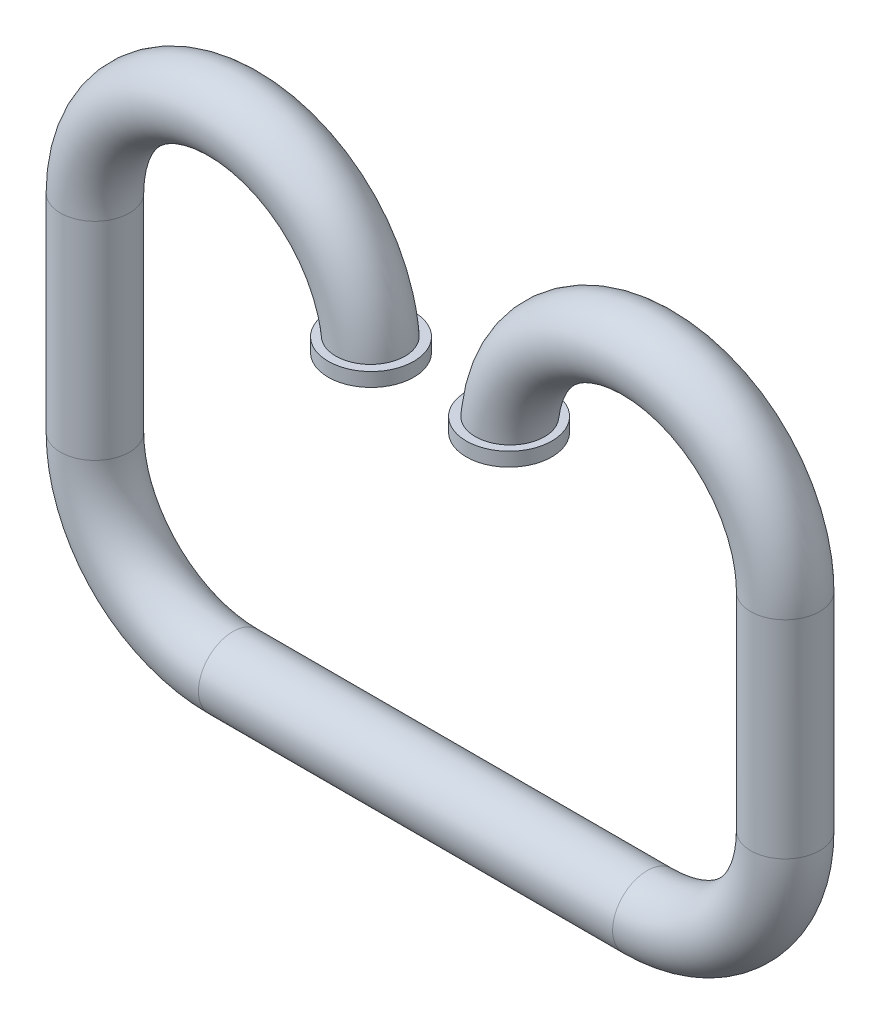
ISO-10303-21;
HEADER;
FILE_DESCRIPTION(('STEP AP214'),'2;1');
FILE_NAME('part.step','',(''),(''),'','','');
FILE_SCHEMA(('AUTOMOTIVE_DESIGN { 1 0 10303 214 1 1 1 1 }'));
ENDSEC;
DATA;
#1=APPLICATION_CONTEXT('core data for automotive mechanical design processes');
#2=APPLICATION_PROTOCOL_DEFINITION('international standard','automotive_design',2000,#1);
#3=PRODUCT_CONTEXT('',#1,'mechanical');
#4=PRODUCT('Part','Part','',(#3));
#5=PRODUCT_RELATED_PRODUCT_CATEGORY('part','',(#4));
#6=PRODUCT_DEFINITION_FORMATION('','',#4);
#7=PRODUCT_DEFINITION_CONTEXT('part definition',#1,'design');
#8=PRODUCT_DEFINITION('design','',#6,#7);
#9=PRODUCT_DEFINITION_SHAPE('','',#8);
#10=(LENGTH_UNIT() NAMED_UNIT(*) SI_UNIT(.MILLI.,.METRE.));
#11=(NAMED_UNIT(*) PLANE_ANGLE_UNIT() SI_UNIT($,.RADIAN.));
#12=(NAMED_UNIT(*) SI_UNIT($,.STERADIAN.) SOLID_ANGLE_UNIT());
#13=UNCERTAINTY_MEASURE_WITH_UNIT(LENGTH_MEASURE(1.E-05),#10,'distance_accuracy_value','');
#14=(GEOMETRIC_REPRESENTATION_CONTEXT(3) GLOBAL_UNCERTAINTY_ASSIGNED_CONTEXT((#13)) GLOBAL_UNIT_ASSIGNED_CONTEXT((#10,
#11,#12)) REPRESENTATION_CONTEXT('',''));
#15=CARTESIAN_POINT('',(0.,0.,0.));
#16=DIRECTION('',(0.,0.,1.));
#17=DIRECTION('',(1.,0.,0.));
#18=AXIS2_PLACEMENT_3D('',#15,#16,#17);
#19=CARTESIAN_POINT('',(-1.,-2.5,0.));
#20=DIRECTION('',(1.,0.,0.));
#21=DIRECTION('',(0.,1.,0.));
#22=AXIS2_PLACEMENT_3D('',#19,#20,#21);
#23=CYLINDRICAL_SURFACE('',#22,0.25);
#24=CARTESIAN_POINT('',(-1.,-2.5,0.));
#25=DIRECTION('',(1.,0.,0.));
#26=DIRECTION('',(0.,1.,0.));
#27=AXIS2_PLACEMENT_3D('',#24,#25,#26);
#28=CIRCLE('',#27,0.25);
#29=CARTESIAN_POINT('',(-1.,-2.75,0.));
#30=VERTEX_POINT('',#29);
#31=EDGE_CURVE('E10',#30,#30,#28,.T.);
#32=ORIENTED_EDGE('',*,*,#31,.T.);
#33=EDGE_LOOP('',(#32));
#34=FACE_BOUND('',#33,.T.);
#35=CARTESIAN_POINT('',(2.,-2.5,0.));
#36=DIRECTION('',(1.,0.,0.));
#37=DIRECTION('',(0.,1.,0.));
#38=AXIS2_PLACEMENT_3D('',#35,#36,#37);
#39=CIRCLE('',#38,0.25);
#40=CARTESIAN_POINT('',(2.,-2.75,0.));
#41=VERTEX_POINT('',#40);
#42=EDGE_CURVE('E74',#41,#41,#39,.T.);
#43=ORIENTED_EDGE('',*,*,#42,.F.);
#44=EDGE_LOOP('',(#43));
#45=FACE_BOUND('',#44,.T.);
#46=ADVANCED_FACE('F31',(#34,#45),#23,.T.);
#47=CARTESIAN_POINT('',(-1.,-1.5,0.));
#48=DIRECTION('',(0.,0.,1.));
#49=DIRECTION('',(1.,0.,0.));
#50=AXIS2_PLACEMENT_3D('',#47,#48,#49);
#51=TOROIDAL_SURFACE('',#50,1.,0.25);
#52=CARTESIAN_POINT('',(-2.,-1.5,0.));
#53=DIRECTION('',(0.,1.,0.));
#54=DIRECTION('',(-1.,0.,0.));
#55=AXIS2_PLACEMENT_3D('',#52,#53,#54);
#56=CIRCLE('',#55,0.25);
#57=CARTESIAN_POINT('',(-2.25,-1.5,0.));
#58=VERTEX_POINT('',#57);
#59=EDGE_CURVE('E43',#58,#58,#56,.F.);
#60=CARTESIAN_POINT('',(-1.,-1.5,0.));
#61=DIRECTION('',(0.,0.,1.));
#62=DIRECTION('',(1.,0.,0.));
#63=AXIS2_PLACEMENT_3D('',#60,#61,#62);
#64=CIRCLE('',#63,1.25);
#65=EDGE_CURVE('',#58,#30,#64,.T.);
#66=ORIENTED_EDGE('',*,*,#59,.T.);
#67=ORIENTED_EDGE('',*,*,#31,.F.);
#68=ORIENTED_EDGE('',*,*,#65,.T.);
#69=ORIENTED_EDGE('',*,*,#65,.F.);
#70=EDGE_LOOP('',(#66,#68,#67,#69));
#71=FACE_BOUND('',#70,.T.);
#72=ADVANCED_FACE('F131',(#71),#51,.T.);
#73=CARTESIAN_POINT('',(-2.,0.,0.));
#74=DIRECTION('',(0.,-1.,0.));
#75=DIRECTION('',(1.,0.,0.));
#76=AXIS2_PLACEMENT_3D('',#73,#74,#75);
#77=CYLINDRICAL_SURFACE('',#76,0.25);
#78=CARTESIAN_POINT('',(-2.,0.,0.));
#79=DIRECTION('',(0.,-1.,0.));
#80=DIRECTION('',(1.,0.,0.));
#81=AXIS2_PLACEMENT_3D('',#78,#79,#80);
#82=CIRCLE('',#81,0.25);
#83=CARTESIAN_POINT('',(-1.75,0.,0.));
#84=VERTEX_POINT('',#83);
#85=EDGE_CURVE('E48',#84,#84,#82,.T.);
#86=ORIENTED_EDGE('',*,*,#85,.T.);
#87=EDGE_LOOP('',(#86));
#88=FACE_BOUND('',#87,.T.);
#89=ORIENTED_EDGE('',*,*,#59,.F.);
#90=EDGE_LOOP('',(#89));
#91=FACE_BOUND('',#90,.T.);
#92=ADVANCED_FACE('F133',(#88,#91),#77,.T.);
#93=CARTESIAN_POINT('',(-1.,0.,0.));
#94=DIRECTION('',(0.,0.,-1.));
#95=DIRECTION('',(-1.,0.,0.));
#96=AXIS2_PLACEMENT_3D('',#93,#94,#95);
#97=TOROIDAL_SURFACE('',#96,1.,0.25);
#98=CARTESIAN_POINT('',(-0.201401096317609,0.1,-0.156239637939055));
#99=CARTESIAN_POINT('',(-0.210190615714738,0.1,-0.145344468335609));
#100=CARTESIAN_POINT('',(-0.218071722109463,0.1,-0.133703962300581));
#101=CARTESIAN_POINT('',(-0.231777903107573,0.1,-0.109257379143088));
#102=CARTESIAN_POINT('',(-0.237600690405998,0.1,-0.0964500251078349));
#103=CARTESIAN_POINT('',(-0.247007650165607,0.1,-0.0700386597896411));
#104=CARTESIAN_POINT('',(-0.250592194362358,0.1,-0.0564347812071185));
#105=CARTESIAN_POINT('',(-0.255413188399921,0.1,-0.0288206461573356));
#106=CARTESIAN_POINT('',(-0.256650230465359,0.1,-0.014810493090211));
#107=CARTESIAN_POINT('',(-0.25674012956133,0.1,0.0131538110387401));
#108=CARTESIAN_POINT('',(-0.255603761287644,0.1,0.0271079282969862));
#109=CARTESIAN_POINT('',(-0.251003172674125,0.1,0.0546272137432172));
#110=CARTESIAN_POINT('',(-0.247538882318156,0.1,0.0681923702197628));
#111=CARTESIAN_POINT('',(-0.238388633745031,0.1,0.0945453892648772));
#112=CARTESIAN_POINT('',(-0.232703487129412,0.1,0.107333533818285));
#113=CARTESIAN_POINT('',(-0.219279773062284,0.1,0.131782096781473));
#114=CARTESIAN_POINT('',(-0.211541147629265,0.1,0.143442483335476));
#115=CARTESIAN_POINT('',(-0.194180832606932,0.1,0.16538311643698));
#116=CARTESIAN_POINT('',(-0.18454778916345,0.1,0.175654378083548));
#117=CARTESIAN_POINT('',(-0.163705864908683,0.1,0.194449314988614));
#118=CARTESIAN_POINT('',(-0.152496920871618,0.1,0.202972920096664));
#119=CARTESIAN_POINT('',(-0.128727432177818,0.1,0.218098495866874));
#120=CARTESIAN_POINT('',(-0.116157110459004,0.1,0.224685104803622));
#121=CARTESIAN_POINT('',(-0.0900925582958239,0.1,0.235665425768117));
#122=CARTESIAN_POINT('',(-0.0765983014200872,0.1,0.240059075031189));
#123=CARTESIAN_POINT('',(-0.0490037254832951,0.1,0.246545191192852));
#124=CARTESIAN_POINT('',(-0.0349009697958583,0.1,0.248627297728038));
#125=CARTESIAN_POINT('',(-0.00654593496886681,0.1,0.250394447161815));
#126=CARTESIAN_POINT('',(0.00770634481024823,0.1,0.250079479803207));
#127=CARTESIAN_POINT('',(0.0359552161641338,0.1,0.247058139402245));
#128=CARTESIAN_POINT('',(0.0499518104184512,0.1,0.244351791435899));
#129=CARTESIAN_POINT('',(0.0772894135497917,0.1,0.236620477359455));
#130=CARTESIAN_POINT('',(0.0906304308904239,0.1,0.23159554119143));
#131=CARTESIAN_POINT('',(0.116234413487642,0.1,0.219384869006445));
#132=CARTESIAN_POINT('',(0.128500521169366,0.1,0.212205722852414));
#133=CARTESIAN_POINT('',(0.151646839119026,0.1,0.195882113872184));
#134=CARTESIAN_POINT('',(0.162527077997131,0.1,0.186737691628039));
#135=CARTESIAN_POINT('',(0.182546180432526,0.1,0.166782766405174));
#136=CARTESIAN_POINT('',(0.191691887715395,0.1,0.155979129073377));
#137=CARTESIAN_POINT('',(0.208031942604488,0.1,0.132985122648441));
#138=CARTESIAN_POINT('',(0.215226328920527,0.1,0.120794781071202));
#139=CARTESIAN_POINT('',(0.227433287128235,0.1,0.095420262938804));
#140=CARTESIAN_POINT('',(0.232453530620286,0.1,0.0822397766594054));
#141=CARTESIAN_POINT('',(0.240204253167929,0.1,0.0552219448415194));
#142=CARTESIAN_POINT('',(0.242934765237328,0.1,0.0413846087766634));
#143=CARTESIAN_POINT('',(0.246023480720513,0.1,0.0134795739953029));
#144=CARTESIAN_POINT('',(0.246387057425578,0.1,-0.000587530219673161));
#145=CARTESIAN_POINT('',(0.244745727650856,0.1,-0.0285828177191339));
#146=CARTESIAN_POINT('',(0.242740835396257,0.1,-0.0425110018374756));
#147=CARTESIAN_POINT('',(0.236422429745385,0.1,-0.0698241464986361));
#148=CARTESIAN_POINT('',(0.232110367704181,0.1,-0.0832094428634803));
#149=CARTESIAN_POINT('',(0.221302613835047,0.1,-0.109067212165587));
#150=CARTESIAN_POINT('',(0.21480691921559,0.1,-0.121539683935882));
#151=CARTESIAN_POINT('',(0.19980999110781,0.1,-0.145233133026621));
#152=CARTESIAN_POINT('',(0.191306581255812,0.1,-0.156452732655624));
#153=CARTESIAN_POINT('',(0.172541402772618,0.1,-0.177309784421281));
#154=CARTESIAN_POINT('',(0.162279611876264,0.1,-0.18694721652102));
#155=CARTESIAN_POINT('',(0.140260536178512,0.1,-0.20439458897411));
#156=CARTESIAN_POINT('',(0.128499350856914,0.1,-0.212199606378334));
#157=CARTESIAN_POINT('',(0.103837454519992,0.1,-0.225732886882564));
#158=CARTESIAN_POINT('',(0.0909367201277325,0.1,-0.231461107366438));
#159=CARTESIAN_POINT('',(0.0643098227029985,0.1,-0.240701650163389));
#160=CARTESIAN_POINT('',(0.0505807148736025,0.1,-0.244205486570355));
#161=CARTESIAN_POINT('',(0.0227304868784085,0.1,-0.248868281721869));
#162=CARTESIAN_POINT('',(0.00860937300525726,0.1,-0.250027278084741));
#163=CARTESIAN_POINT('',(-0.019682310331464,0.1,-0.249971637934856));
#164=CARTESIAN_POINT('',(-0.033852861838134,0.1,-0.248747884057992));
#165=CARTESIAN_POINT('',(-0.0617929096379455,0.1,-0.243944388235435));
#166=CARTESIAN_POINT('',(-0.0755622983800522,0.1,-0.240364020446176));
#167=CARTESIAN_POINT('',(-0.102345731745449,0.1,-0.230935097081438));
#168=CARTESIAN_POINT('',(-0.115357430686798,0.1,-0.225079887987269));
#169=CARTESIAN_POINT('',(-0.140200186875687,0.1,-0.211269182973001));
#170=CARTESIAN_POINT('',(-0.152032625018917,0.1,-0.203316184310893));
#171=CARTESIAN_POINT('',(-0.170150558895375,0.1,-0.188776882063845));
#172=CARTESIAN_POINT('',(-0.176888616987927,0.1,-0.182745072414764));
#173=CARTESIAN_POINT('',(-0.189677604716015,0.1,-0.169992202553551));
#174=CARTESIAN_POINT('',(-0.195728533355725,0.1,-0.163271141342544));
#175=CARTESIAN_POINT('',(-0.201401096317609,0.1,-0.156239637939055));
#176=B_SPLINE_CURVE_WITH_KNOTS('',3,(#98,#99,#100,#101,#102,#103,#104,#105,#106,#107,#108,#109,
#110,#111,#112,#113,#114,#115,#116,#117,#118,#119,#120,#121,#122,#123,#124,#125,#126,#127,#128,
#129,#130,#131,#132,#133,#134,#135,#136,#137,#138,#139,#140,#141,#142,#143,#144,#145,#146,#147,
#148,#149,#150,#151,#152,#153,#154,#155,#156,#157,#158,#159,#160,#161,#162,#163,#164,#165,#166,
#167,#168,#169,#170,#171,#172,#173,#174,#175),.UNSPECIFIED.,.T.,.F.,(4,2,2,2,2,2,2,2,2,2,2,2,2,
2,2,2,2,2,2,2,2,2,2,2,2,2,2,2,2,2,2,2,2,2,2,2,2,2,4),(0.,0.0419631052503927,0.0839726964411998,
0.125975308668973,0.167967323125762,0.209769118662524,0.251572171514233,0.293359961905662,
0.335148932332196,0.377196440897467,0.419245636907758,0.461619835954524,0.503995247723257,
0.54655982933734,0.589124593087473,0.631688910508933,0.6742526782734,0.716687545691694,
0.759121536933535,0.801384450217337,0.843646525038763,0.88575823574167,0.927869339259047,
0.969884810944664,1.01190003028372,1.05388885042508,1.09587772424463,1.13791232469054,
1.17994745743075,1.22209426111071,1.26424192959939,1.30654943795309,1.34885626756105,
1.39132529833847,1.43380561212635,1.47641112039157,1.51896613717817,1.5460481653165,
1.57313023270311),.UNSPECIFIED.);
#177=CARTESIAN_POINT('',(-0.201401096317609,0.1,-0.156239637939055));
#178=VERTEX_POINT('',#177);
#179=EDGE_CURVE('E36',#178,#178,#176,.T.);
#180=ORIENTED_EDGE('',*,*,#179,.T.);
#181=EDGE_LOOP('',(#180));
#182=FACE_BOUND('',#181,.T.);
#183=ORIENTED_EDGE('',*,*,#85,.F.);
#184=EDGE_LOOP('',(#183));
#185=FACE_BOUND('',#184,.T.);
#186=ADVANCED_FACE('F33',(#182,#185),#97,.T.);
#187=CARTESIAN_POINT('',(0.,0.,0.));
#188=DIRECTION('',(0.,1.,0.));
#189=DIRECTION('',(0.,0.,1.));
#190=AXIS2_PLACEMENT_3D('',#187,#188,#189);
#191=PLANE('',#190);
#192=CARTESIAN_POINT('',(0.,0.,0.));
#193=DIRECTION('',(0.,1.,0.));
#194=DIRECTION('',(0.,0.,1.));
#195=AXIS2_PLACEMENT_3D('',#192,#193,#194);
#196=CIRCLE('',#195,0.2);
#197=CARTESIAN_POINT('',(0.2,0.,0.));
#198=VERTEX_POINT('',#197);
#199=EDGE_CURVE('E65',#198,#198,#196,.T.);
#200=ORIENTED_EDGE('',*,*,#199,.T.);
#201=EDGE_LOOP('',(#200));
#202=FACE_BOUND('',#201,.T.);
#203=CARTESIAN_POINT('',(0.,0.,0.));
#204=DIRECTION('',(0.,1.,0.));
#205=DIRECTION('',(0.,0.,1.));
#206=AXIS2_PLACEMENT_3D('',#203,#204,#205);
#207=CIRCLE('',#206,0.31);
#208=CARTESIAN_POINT('',(0.,0.,0.31));
#209=VERTEX_POINT('',#208);
#210=EDGE_CURVE('E70',#209,#209,#207,.T.);
#211=ORIENTED_EDGE('',*,*,#210,.F.);
#212=EDGE_LOOP('',(#211));
#213=FACE_BOUND('',#212,.T.);
#214=ADVANCED_FACE('F124',(#202,#213),#191,.F.);
#215=CARTESIAN_POINT('',(-1.,-2.5,0.));
#216=DIRECTION('',(1.,0.,0.));
#217=DIRECTION('',(0.,1.,0.));
#218=AXIS2_PLACEMENT_3D('',#215,#216,#217);
#219=CYLINDRICAL_SURFACE('',#218,0.2);
#220=CARTESIAN_POINT('',(-1.,-2.5,0.));
#221=DIRECTION('',(1.,0.,0.));
#222=DIRECTION('',(0.,0.,1.));
#223=AXIS2_PLACEMENT_3D('',#220,#221,#222);
#224=CIRCLE('',#223,0.2);
#225=CARTESIAN_POINT('',(-1.,-2.7,0.));
#226=VERTEX_POINT('',#225);
#227=EDGE_CURVE('E51',#226,#226,#224,.T.);
#228=ORIENTED_EDGE('',*,*,#227,.F.);
#229=EDGE_LOOP('',(#228));
#230=FACE_BOUND('',#229,.T.);
#231=CARTESIAN_POINT('',(2.,-2.5,0.));
#232=DIRECTION('',(1.,0.,0.));
#233=DIRECTION('',(0.,0.,1.));
#234=AXIS2_PLACEMENT_3D('',#231,#232,#233);
#235=CIRCLE('',#234,0.2);
#236=CARTESIAN_POINT('',(2.,-2.7,0.));
#237=VERTEX_POINT('',#236);
#238=EDGE_CURVE('E319',#237,#237,#235,.T.);
#239=ORIENTED_EDGE('',*,*,#238,.T.);
#240=EDGE_LOOP('',(#239));
#241=FACE_BOUND('',#240,.T.);
#242=ADVANCED_FACE('F120',(#230,#241),#219,.F.);
#243=CARTESIAN_POINT('',(-1.,-1.5,0.));
#244=DIRECTION('',(0.,0.,1.));
#245=DIRECTION('',(1.,0.,0.));
#246=AXIS2_PLACEMENT_3D('',#243,#244,#245);
#247=TOROIDAL_SURFACE('',#246,1.,0.2);
#248=CARTESIAN_POINT('',(-2.,-1.5,0.));
#249=DIRECTION('',(0.,-1.,0.));
#250=DIRECTION('',(0.,0.,1.));
#251=AXIS2_PLACEMENT_3D('',#248,#249,#250);
#252=CIRCLE('',#251,0.2);
#253=CARTESIAN_POINT('',(-2.2,-1.5,0.));
#254=VERTEX_POINT('',#253);
#255=EDGE_CURVE('E57',#254,#254,#252,.T.);
#256=CARTESIAN_POINT('',(-1.,-1.5,0.));
#257=DIRECTION('',(0.,0.,1.));
#258=DIRECTION('',(1.,0.,0.));
#259=AXIS2_PLACEMENT_3D('',#256,#257,#258);
#260=CIRCLE('',#259,1.2);
#261=EDGE_CURVE('',#254,#226,#260,.T.);
#262=ORIENTED_EDGE('',*,*,#255,.F.);
#263=ORIENTED_EDGE('',*,*,#227,.T.);
#264=ORIENTED_EDGE('',*,*,#261,.T.);
#265=ORIENTED_EDGE('',*,*,#261,.F.);
#266=EDGE_LOOP('',(#262,#264,#263,#265));
#267=FACE_BOUND('',#266,.T.);
#268=ADVANCED_FACE('F116',(#267),#247,.F.);
#269=CARTESIAN_POINT('',(-2.,0.,0.));
#270=DIRECTION('',(0.,-1.,0.));
#271=DIRECTION('',(1.,0.,0.));
#272=AXIS2_PLACEMENT_3D('',#269,#270,#271);
#273=CYLINDRICAL_SURFACE('',#272,0.2);
#274=CARTESIAN_POINT('',(-2.,0.,0.));
#275=DIRECTION('',(0.,-1.,0.));
#276=DIRECTION('',(0.,0.,1.));
#277=AXIS2_PLACEMENT_3D('',#274,#275,#276);
#278=CIRCLE('',#277,0.2);
#279=CARTESIAN_POINT('',(-2.2,0.,0.));
#280=VERTEX_POINT('',#279);
#281=EDGE_CURVE('E61',#280,#280,#278,.T.);
#282=ORIENTED_EDGE('',*,*,#281,.F.);
#283=EDGE_LOOP('',(#282));
#284=FACE_BOUND('',#283,.T.);
#285=ORIENTED_EDGE('',*,*,#255,.T.);
#286=EDGE_LOOP('',(#285));
#287=FACE_BOUND('',#286,.T.);
#288=ADVANCED_FACE('F112',(#284,#287),#273,.F.);
#289=CARTESIAN_POINT('',(-1.,0.,0.));
#290=DIRECTION('',(0.,0.,-1.));
#291=DIRECTION('',(-1.,0.,0.));
#292=AXIS2_PLACEMENT_3D('',#289,#290,#291);
#293=TOROIDAL_SURFACE('',#292,1.,0.2);
#294=CARTESIAN_POINT('',(-1.,0.,0.));
#295=DIRECTION('',(0.,0.,-1.));
#296=DIRECTION('',(-1.,0.,0.));
#297=AXIS2_PLACEMENT_3D('',#294,#295,#296);
#298=CIRCLE('',#297,1.2);
#299=EDGE_CURVE('',#280,#198,#298,.T.);
#300=ORIENTED_EDGE('',*,*,#281,.T.);
#301=ORIENTED_EDGE('',*,*,#199,.F.);
#302=ORIENTED_EDGE('',*,*,#299,.T.);
#303=ORIENTED_EDGE('',*,*,#299,.F.);
#304=EDGE_LOOP('',(#300,#302,#301,#303));
#305=FACE_BOUND('',#304,.T.);
#306=ADVANCED_FACE('F104',(#305),#293,.F.);
#307=CARTESIAN_POINT('',(0.,0.1,0.));
#308=DIRECTION('',(0.,1.,0.));
#309=DIRECTION('',(0.,0.,1.));
#310=AXIS2_PLACEMENT_3D('',#307,#308,#309);
#311=PLANE('',#310);
#312=CARTESIAN_POINT('',(0.,0.1,0.));
#313=DIRECTION('',(0.,1.,0.));
#314=DIRECTION('',(0.,0.,1.));
#315=AXIS2_PLACEMENT_3D('',#312,#313,#314);
#316=CIRCLE('',#315,0.31);
#317=CARTESIAN_POINT('',(0.,0.1,0.31));
#318=VERTEX_POINT('',#317);
#319=EDGE_CURVE('E73',#318,#318,#316,.T.);
#320=ORIENTED_EDGE('',*,*,#319,.T.);
#321=EDGE_LOOP('',(#320));
#322=FACE_BOUND('',#321,.T.);
#323=ORIENTED_EDGE('',*,*,#179,.F.);
#324=EDGE_LOOP('',(#323));
#325=FACE_BOUND('',#324,.T.);
#326=ADVANCED_FACE('F99',(#322,#325),#311,.T.);
#327=CARTESIAN_POINT('',(0.,0.1,0.));
#328=DIRECTION('',(0.,-1.,0.));
#329=DIRECTION('',(0.,0.,-1.));
#330=AXIS2_PLACEMENT_3D('',#327,#328,#329);
#331=CYLINDRICAL_SURFACE('',#330,0.31);
#332=ORIENTED_EDGE('',*,*,#319,.F.);
#333=EDGE_LOOP('',(#332));
#334=FACE_BOUND('',#333,.T.);
#335=ORIENTED_EDGE('',*,*,#210,.T.);
#336=EDGE_LOOP('',(#335));
#337=FACE_BOUND('',#336,.T.);
#338=ADVANCED_FACE('F103',(#334,#337),#331,.T.);
#339=CARTESIAN_POINT('',(2.,-1.5,0.));
#340=DIRECTION('',(0.,0.,1.));
#341=DIRECTION('',(-1.,0.,0.));
#342=AXIS2_PLACEMENT_3D('',#339,#340,#341);
#343=TOROIDAL_SURFACE('',#342,1.,0.25);
#344=CARTESIAN_POINT('',(3.,-1.5,0.));
#345=DIRECTION('',(0.,-1.,0.));
#346=DIRECTION('',(1.,0.,0.));
#347=AXIS2_PLACEMENT_3D('',#344,#345,#346);
#348=CIRCLE('',#347,0.25);
#349=CARTESIAN_POINT('',(3.25,-1.5,0.));
#350=VERTEX_POINT('',#349);
#351=EDGE_CURVE('E323',#350,#350,#348,.F.);
#352=CARTESIAN_POINT('',(2.,-1.5,0.));
#353=DIRECTION('',(0.,0.,1.));
#354=DIRECTION('',(-1.,0.,0.));
#355=AXIS2_PLACEMENT_3D('',#352,#353,#354);
#356=CIRCLE('',#355,1.25);
#357=EDGE_CURVE('',#41,#350,#356,.T.);
#358=ORIENTED_EDGE('',*,*,#42,.T.);
#359=ORIENTED_EDGE('',*,*,#351,.F.);
#360=ORIENTED_EDGE('',*,*,#357,.T.);
#361=ORIENTED_EDGE('',*,*,#357,.F.);
#362=EDGE_LOOP('',(#358,#360,#359,#361));
#363=FACE_BOUND('',#362,.T.);
#364=ADVANCED_FACE('F108',(#363),#343,.T.);
#365=CARTESIAN_POINT('',(3.,0.,0.));
#366=DIRECTION('',(0.,-1.,0.));
#367=DIRECTION('',(-1.,0.,0.));
#368=AXIS2_PLACEMENT_3D('',#365,#366,#367);
#369=CYLINDRICAL_SURFACE('',#368,0.25);
#370=CARTESIAN_POINT('',(3.,0.,0.));
#371=DIRECTION('',(0.,1.,0.));
#372=DIRECTION('',(-1.,0.,0.));
#373=AXIS2_PLACEMENT_3D('',#370,#371,#372);
#374=CIRCLE('',#373,0.25);
#375=CARTESIAN_POINT('',(2.75,0.,0.));
#376=VERTEX_POINT('',#375);
#377=EDGE_CURVE('E86',#376,#376,#374,.T.);
#378=ORIENTED_EDGE('',*,*,#377,.F.);
#379=EDGE_LOOP('',(#378));
#380=FACE_BOUND('',#379,.T.);
#381=ORIENTED_EDGE('',*,*,#351,.T.);
#382=EDGE_LOOP('',(#381));
#383=FACE_BOUND('',#382,.T.);
#384=ADVANCED_FACE('F96',(#380,#383),#369,.T.);
#385=CARTESIAN_POINT('',(2.,0.,0.));
#386=DIRECTION('',(0.,0.,-1.));
#387=DIRECTION('',(1.,0.,0.));
#388=AXIS2_PLACEMENT_3D('',#385,#386,#387);
#389=TOROIDAL_SURFACE('',#388,1.,0.25);
#390=CARTESIAN_POINT('',(1.20140109631761,0.0999999999999994,-0.156239637939055));
#391=CARTESIAN_POINT('',(1.21019061571474,0.0999999999999994,-0.145344468335609));
#392=CARTESIAN_POINT('',(1.21807172210946,0.0999999999999994,-0.133703962300581));
#393=CARTESIAN_POINT('',(1.23177790310757,0.0999999999999994,-0.109257379143088));
#394=CARTESIAN_POINT('',(1.237600690406,0.0999999999999994,-0.096450025107835));
#395=CARTESIAN_POINT('',(1.24700765016561,0.0999999999999994,-0.0700386597896411));
#396=CARTESIAN_POINT('',(1.25059219436236,0.0999999999999994,-0.0564347812071185));
#397=CARTESIAN_POINT('',(1.25541318839992,0.0999999999999994,-0.0288206461573356));
#398=CARTESIAN_POINT('',(1.25665023046536,0.0999999999999994,-0.014810493090211));
#399=CARTESIAN_POINT('',(1.25674012956133,0.0999999999999994,0.0131538110387401));
#400=CARTESIAN_POINT('',(1.25560376128764,0.0999999999999994,0.0271079282969863));
#401=CARTESIAN_POINT('',(1.25100317267413,0.0999999999999994,0.0546272137432173));
#402=CARTESIAN_POINT('',(1.24753888231816,0.0999999999999994,0.0681923702197628));
#403=CARTESIAN_POINT('',(1.23838863374503,0.0999999999999994,0.0945453892648773));
#404=CARTESIAN_POINT('',(1.23270348712941,0.0999999999999994,0.107333533818285));
#405=CARTESIAN_POINT('',(1.21927977306228,0.0999999999999994,0.131782096781474));
#406=CARTESIAN_POINT('',(1.21154114762927,0.0999999999999994,0.143442483335476));
#407=CARTESIAN_POINT('',(1.19418083260693,0.0999999999999995,0.16538311643698));
#408=CARTESIAN_POINT('',(1.18454778916345,0.0999999999999995,0.175654378083549));
#409=CARTESIAN_POINT('',(1.16370586490868,0.0999999999999995,0.194449314988614));
#410=CARTESIAN_POINT('',(1.15249692087162,0.0999999999999995,0.202972920096664));
#411=CARTESIAN_POINT('',(1.12872743217782,0.0999999999999995,0.218098495866874));
#412=CARTESIAN_POINT('',(1.11615711045901,0.0999999999999995,0.224685104803622));
#413=CARTESIAN_POINT('',(1.09009255829582,0.0999999999999995,0.235665425768117));
#414=CARTESIAN_POINT('',(1.07659830142009,0.0999999999999995,0.240059075031189));
#415=CARTESIAN_POINT('',(1.0490037254833,0.0999999999999996,0.246545191192852));
#416=CARTESIAN_POINT('',(1.03490096979586,0.0999999999999996,0.248627297728038));
#417=CARTESIAN_POINT('',(1.00654593496887,0.0999999999999996,0.250394447161815));
#418=CARTESIAN_POINT('',(0.992293655189753,0.0999999999999996,0.250079479803207));
#419=CARTESIAN_POINT('',(0.964044783835867,0.0999999999999996,0.247058139402245));
#420=CARTESIAN_POINT('',(0.95004818958155,0.0999999999999996,0.244351791435899));
#421=CARTESIAN_POINT('',(0.922710586450209,0.0999999999999997,0.236620477359455));
#422=CARTESIAN_POINT('',(0.909369569109577,0.0999999999999997,0.23159554119143));
#423=CARTESIAN_POINT('',(0.883765586512359,0.0999999999999997,0.219384869006445));
#424=CARTESIAN_POINT('',(0.871499478830634,0.0999999999999997,0.212205722852414));
#425=CARTESIAN_POINT('',(0.848353160880975,0.0999999999999997,0.195882113872184));
#426=CARTESIAN_POINT('',(0.837472922002869,0.0999999999999997,0.186737691628039));
#427=CARTESIAN_POINT('',(0.817453819567474,0.0999999999999997,0.166782766405174));
#428=CARTESIAN_POINT('',(0.808308112284606,0.0999999999999997,0.155979129073377));
#429=CARTESIAN_POINT('',(0.791968057395513,0.0999999999999998,0.132985122648441));
#430=CARTESIAN_POINT('',(0.784773671079474,0.0999999999999998,0.120794781071202));
#431=CARTESIAN_POINT('',(0.772566712871766,0.0999999999999998,0.095420262938804));
#432=CARTESIAN_POINT('',(0.767546469379715,0.0999999999999998,0.0822397766594054));
#433=CARTESIAN_POINT('',(0.759795746832072,0.0999999999999998,0.0552219448415193));
#434=CARTESIAN_POINT('',(0.757065234762672,0.0999999999999998,0.0413846087766634));
#435=CARTESIAN_POINT('',(0.753976519279488,0.0999999999999998,0.013479573995303));
#436=CARTESIAN_POINT('',(0.753612942574423,0.0999999999999998,-0.000587530219673126));
#437=CARTESIAN_POINT('',(0.755254272349145,0.0999999999999998,-0.0285828177191339));
#438=CARTESIAN_POINT('',(0.757259164603744,0.0999999999999998,-0.0425110018374756));
#439=CARTESIAN_POINT('',(0.763577570254616,0.0999999999999998,-0.069824146498636));
#440=CARTESIAN_POINT('',(0.76788963229582,0.0999999999999998,-0.0832094428634802));
#441=CARTESIAN_POINT('',(0.778697386164953,0.0999999999999998,-0.109067212165587));
#442=CARTESIAN_POINT('',(0.785193080784411,0.0999999999999998,-0.121539683935882));
#443=CARTESIAN_POINT('',(0.800190008892191,0.0999999999999997,-0.145233133026621));
#444=CARTESIAN_POINT('',(0.808693418744189,0.0999999999999997,-0.156452732655624));
#445=CARTESIAN_POINT('',(0.827458597227383,0.0999999999999997,-0.177309784421281));
#446=CARTESIAN_POINT('',(0.837720388123736,0.0999999999999997,-0.18694721652102));
#447=CARTESIAN_POINT('',(0.859739463821489,0.0999999999999997,-0.20439458897411));
#448=CARTESIAN_POINT('',(0.871500649143087,0.0999999999999997,-0.212199606378334));
#449=CARTESIAN_POINT('',(0.896162545480009,0.0999999999999997,-0.225732886882564));
#450=CARTESIAN_POINT('',(0.909063279872268,0.0999999999999997,-0.231461107366438));
#451=CARTESIAN_POINT('',(0.935690177297002,0.0999999999999997,-0.240701650163389));
#452=CARTESIAN_POINT('',(0.949419285126398,0.0999999999999996,-0.244205486570355));
#453=CARTESIAN_POINT('',(0.977269513121592,0.0999999999999996,-0.248868281721869));
#454=CARTESIAN_POINT('',(0.991390626994743,0.0999999999999996,-0.250027278084741));
#455=CARTESIAN_POINT('',(1.01968231033146,0.0999999999999996,-0.249971637934856));
#456=CARTESIAN_POINT('',(1.03385286183813,0.0999999999999996,-0.248747884057992));
#457=CARTESIAN_POINT('',(1.06179290963795,0.0999999999999995,-0.243944388235435));
#458=CARTESIAN_POINT('',(1.07556229838005,0.0999999999999995,-0.240364020446176));
#459=CARTESIAN_POINT('',(1.10234573174545,0.0999999999999995,-0.230935097081438));
#460=CARTESIAN_POINT('',(1.1153574306868,0.0999999999999995,-0.225079887987269));
#461=CARTESIAN_POINT('',(1.14020018687569,0.0999999999999995,-0.211269182973001));
#462=CARTESIAN_POINT('',(1.15203262501892,0.0999999999999995,-0.203316184310893));
#463=CARTESIAN_POINT('',(1.17015055889538,0.0999999999999995,-0.188776882063845));
#464=CARTESIAN_POINT('',(1.17688861698793,0.0999999999999995,-0.182745072414765));
#465=CARTESIAN_POINT('',(1.18967760471602,0.0999999999999995,-0.169992202553551));
#466=CARTESIAN_POINT('',(1.19572853335573,0.0999999999999994,-0.163271141342544));
#467=CARTESIAN_POINT('',(1.20140109631761,0.0999999999999994,-0.156239637939055));
#468=B_SPLINE_CURVE_WITH_KNOTS('',3,(#390,#391,#392,#393,#394,#395,#396,#397,#398,#399,#400,
#401,#402,#403,#404,#405,#406,#407,#408,#409,#410,#411,#412,#413,#414,#415,#416,#417,#418,#419,
#420,#421,#422,#423,#424,#425,#426,#427,#428,#429,#430,#431,#432,#433,#434,#435,#436,#437,#438,
#439,#440,#441,#442,#443,#444,#445,#446,#447,#448,#449,#450,#451,#452,#453,#454,#455,#456,#457,
#458,#459,#460,#461,#462,#463,#464,#465,#466,#467),.UNSPECIFIED.,.T.,.F.,(4,2,2,2,2,2,2,2,2,2,2,
2,2,2,2,2,2,2,2,2,2,2,2,2,2,2,2,2,2,2,2,2,2,2,2,2,2,2,4),(0.,0.0419631052503928,
0.0839726964411998,0.125975308668973,0.167967323125762,0.209769118662524,0.251572171514233,
0.293359961905662,0.335148932332196,0.377196440897467,0.419245636907758,0.461619835954524,
0.503995247723258,0.54655982933734,0.589124593087474,0.631688910508933,0.6742526782734,
0.716687545691694,0.759121536933536,0.801384450217337,0.843646525038764,0.88575823574167,
0.927869339259047,0.969884810944665,1.01190003028372,1.05388885042508,1.09587772424463,
1.13791232469054,1.17994745743075,1.22209426111071,1.26424192959939,1.30654943795309,
1.34885626756105,1.39132529833847,1.43380561212635,1.47641112039157,1.51896613717817,
1.5460481653165,1.57313023270311),.UNSPECIFIED.);
#469=CARTESIAN_POINT('',(1.20140109631761,0.0999999999999994,-0.156239637939055));
#470=VERTEX_POINT('',#469);
#471=EDGE_CURVE('E77',#470,#470,#468,.T.);
#472=ORIENTED_EDGE('',*,*,#471,.F.);
#473=EDGE_LOOP('',(#472));
#474=FACE_BOUND('',#473,.T.);
#475=ORIENTED_EDGE('',*,*,#377,.T.);
#476=EDGE_LOOP('',(#475));
#477=FACE_BOUND('',#476,.T.);
#478=ADVANCED_FACE('F91',(#474,#477),#389,.T.);
#479=CARTESIAN_POINT('',(1.,0.,0.));
#480=DIRECTION('',(0.,1.,0.));
#481=DIRECTION('',(0.,0.,1.));
#482=AXIS2_PLACEMENT_3D('',#479,#480,#481);
#483=PLANE('',#482);
#484=CARTESIAN_POINT('',(1.,0.,0.));
#485=DIRECTION('',(0.,-1.,0.));
#486=DIRECTION('',(0.,0.,1.));
#487=AXIS2_PLACEMENT_3D('',#484,#485,#486);
#488=CIRCLE('',#487,0.2);
#489=CARTESIAN_POINT('',(0.800000000000001,0.,0.));
#490=VERTEX_POINT('',#489);
#491=EDGE_CURVE('E84',#490,#490,#488,.T.);
#492=ORIENTED_EDGE('',*,*,#491,.F.);
#493=EDGE_LOOP('',(#492));
#494=FACE_BOUND('',#493,.T.);
#495=CARTESIAN_POINT('',(1.,0.,0.));
#496=DIRECTION('',(0.,-1.,0.));
#497=DIRECTION('',(0.,0.,1.));
#498=AXIS2_PLACEMENT_3D('',#495,#496,#497);
#499=CIRCLE('',#498,0.31);
#500=CARTESIAN_POINT('',(1.,0.,0.31));
#501=VERTEX_POINT('',#500);
#502=EDGE_CURVE('E306',#501,#501,#499,.T.);
#503=ORIENTED_EDGE('',*,*,#502,.T.);
#504=EDGE_LOOP('',(#503));
#505=FACE_BOUND('',#504,.T.);
#506=ADVANCED_FACE('F95',(#494,#505),#483,.F.);
#507=CARTESIAN_POINT('',(2.,-1.5,0.));
#508=DIRECTION('',(0.,0.,1.));
#509=DIRECTION('',(-1.,0.,0.));
#510=AXIS2_PLACEMENT_3D('',#507,#508,#509);
#511=TOROIDAL_SURFACE('',#510,1.,0.2);
#512=CARTESIAN_POINT('',(3.,-1.5,0.));
#513=DIRECTION('',(0.,1.,0.));
#514=DIRECTION('',(0.,0.,1.));
#515=AXIS2_PLACEMENT_3D('',#512,#513,#514);
#516=CIRCLE('',#515,0.2);
#517=CARTESIAN_POINT('',(3.2,-1.5,0.));
#518=VERTEX_POINT('',#517);
#519=EDGE_CURVE('E316',#518,#518,#516,.T.);
#520=CARTESIAN_POINT('',(2.,-1.5,0.));
#521=DIRECTION('',(0.,0.,1.));
#522=DIRECTION('',(-1.,0.,0.));
#523=AXIS2_PLACEMENT_3D('',#520,#521,#522);
#524=CIRCLE('',#523,1.2);
#525=EDGE_CURVE('',#237,#518,#524,.T.);
#526=ORIENTED_EDGE('',*,*,#238,.F.);
#527=ORIENTED_EDGE('',*,*,#519,.T.);
#528=ORIENTED_EDGE('',*,*,#525,.T.);
#529=ORIENTED_EDGE('',*,*,#525,.F.);
#530=EDGE_LOOP('',(#526,#528,#527,#529));
#531=FACE_BOUND('',#530,.T.);
#532=ADVANCED_FACE('F210',(#531),#511,.F.);
#533=CARTESIAN_POINT('',(3.,0.,0.));
#534=DIRECTION('',(0.,-1.,0.));
#535=DIRECTION('',(-1.,0.,0.));
#536=AXIS2_PLACEMENT_3D('',#533,#534,#535);
#537=CYLINDRICAL_SURFACE('',#536,0.2);
#538=CARTESIAN_POINT('',(3.,0.,0.));
#539=DIRECTION('',(0.,1.,0.));
#540=DIRECTION('',(0.,0.,1.));
#541=AXIS2_PLACEMENT_3D('',#538,#539,#540);
#542=CIRCLE('',#541,0.2);
#543=CARTESIAN_POINT('',(3.2,0.,0.));
#544=VERTEX_POINT('',#543);
#545=EDGE_CURVE('E313',#544,#544,#542,.T.);
#546=ORIENTED_EDGE('',*,*,#545,.T.);
#547=EDGE_LOOP('',(#546));
#548=FACE_BOUND('',#547,.T.);
#549=ORIENTED_EDGE('',*,*,#519,.F.);
#550=EDGE_LOOP('',(#549));
#551=FACE_BOUND('',#550,.T.);
#552=ADVANCED_FACE('F218',(#548,#551),#537,.F.);
#553=CARTESIAN_POINT('',(2.,0.,0.));
#554=DIRECTION('',(0.,0.,-1.));
#555=DIRECTION('',(1.,0.,0.));
#556=AXIS2_PLACEMENT_3D('',#553,#554,#555);
#557=TOROIDAL_SURFACE('',#556,1.,0.2);
#558=CARTESIAN_POINT('',(2.,0.,0.));
#559=DIRECTION('',(0.,0.,-1.));
#560=DIRECTION('',(1.,0.,0.));
#561=AXIS2_PLACEMENT_3D('',#558,#559,#560);
#562=CIRCLE('',#561,1.2);
#563=EDGE_CURVE('',#490,#544,#562,.T.);
#564=ORIENTED_EDGE('',*,*,#491,.T.);
#565=ORIENTED_EDGE('',*,*,#545,.F.);
#566=ORIENTED_EDGE('',*,*,#563,.T.);
#567=ORIENTED_EDGE('',*,*,#563,.F.);
#568=EDGE_LOOP('',(#564,#566,#565,#567));
#569=FACE_BOUND('',#568,.T.);
#570=ADVANCED_FACE('F226',(#569),#557,.F.);
#571=CARTESIAN_POINT('',(1.,0.0999999999999996,0.));
#572=DIRECTION('',(0.,1.,0.));
#573=DIRECTION('',(0.,0.,1.));
#574=AXIS2_PLACEMENT_3D('',#571,#572,#573);
#575=PLANE('',#574);
#576=CARTESIAN_POINT('',(1.,0.0999999999999996,0.));
#577=DIRECTION('',(0.,-1.,0.));
#578=DIRECTION('',(0.,0.,1.));
#579=AXIS2_PLACEMENT_3D('',#576,#577,#578);
#580=CIRCLE('',#579,0.31);
#581=CARTESIAN_POINT('',(1.,0.0999999999999996,0.31));
#582=VERTEX_POINT('',#581);
#583=EDGE_CURVE('E85',#582,#582,#580,.T.);
#584=ORIENTED_EDGE('',*,*,#583,.F.);
#585=EDGE_LOOP('',(#584));
#586=FACE_BOUND('',#585,.T.);
#587=ORIENTED_EDGE('',*,*,#471,.T.);
#588=EDGE_LOOP('',(#587));
#589=FACE_BOUND('',#588,.T.);
#590=ADVANCED_FACE('F88',(#586,#589),#575,.T.);
#591=CARTESIAN_POINT('',(1.,0.0999999999999996,0.));
#592=DIRECTION('',(0.,-1.,0.));
#593=DIRECTION('',(0.,0.,-1.));
#594=AXIS2_PLACEMENT_3D('',#591,#592,#593);
#595=CYLINDRICAL_SURFACE('',#594,0.31);
#596=ORIENTED_EDGE('',*,*,#583,.T.);
#597=EDGE_LOOP('',(#596));
#598=FACE_BOUND('',#597,.T.);
#599=ORIENTED_EDGE('',*,*,#502,.F.);
#600=EDGE_LOOP('',(#599));
#601=FACE_BOUND('',#600,.T.);
#602=ADVANCED_FACE('F241',(#598,#601),#595,.T.);
#603=CLOSED_SHELL('',(#46,#72,#92,#186,#214,#242,#268,#288,#306,#326,#338,#364,#384,#478,#506,
#532,#552,#570,#590,#602));
#604=MANIFOLD_SOLID_BREP('B2',#603);
#605=ADVANCED_BREP_SHAPE_REPRESENTATION('',(#18,#604),#14);
#606=SHAPE_DEFINITION_REPRESENTATION(#9,#605);
ENDSEC;
END-ISO-10303-21;
